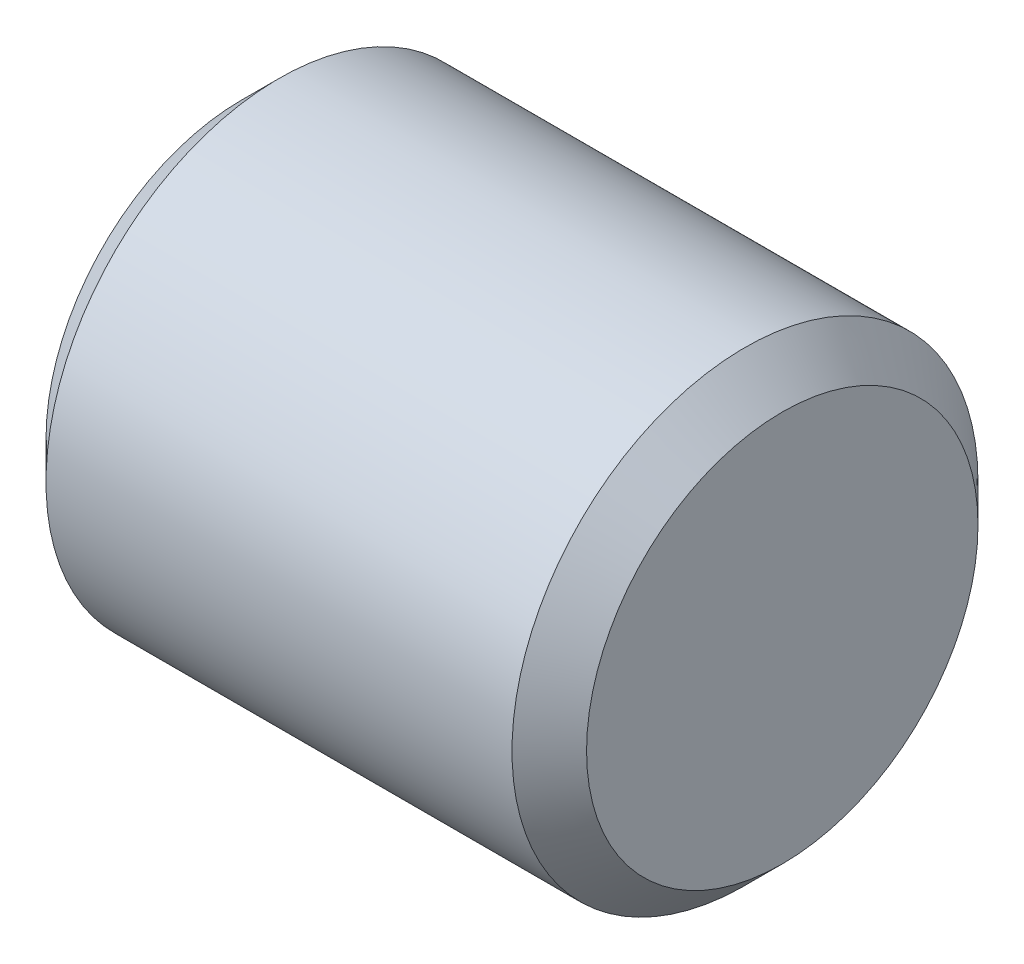
ISO-10303-21;
HEADER;
FILE_DESCRIPTION(('STEP AP214'),'2;1');
FILE_NAME('part.step','',(''),(''),'','','');
FILE_SCHEMA(('AUTOMOTIVE_DESIGN { 1 0 10303 214 1 1 1 1 }'));
ENDSEC;
DATA;
#1=APPLICATION_CONTEXT('core data for automotive mechanical design processes');
#2=APPLICATION_PROTOCOL_DEFINITION('international standard','automotive_design',2000,#1);
#3=PRODUCT_CONTEXT('',#1,'mechanical');
#4=PRODUCT('Part','Part','',(#3));
#5=PRODUCT_RELATED_PRODUCT_CATEGORY('part','',(#4));
#6=PRODUCT_DEFINITION_FORMATION('','',#4);
#7=PRODUCT_DEFINITION_CONTEXT('part definition',#1,'design');
#8=PRODUCT_DEFINITION('design','',#6,#7);
#9=PRODUCT_DEFINITION_SHAPE('','',#8);
#10=(LENGTH_UNIT() NAMED_UNIT(*) SI_UNIT(.MILLI.,.METRE.));
#11=(NAMED_UNIT(*) PLANE_ANGLE_UNIT() SI_UNIT($,.RADIAN.));
#12=(NAMED_UNIT(*) SI_UNIT($,.STERADIAN.) SOLID_ANGLE_UNIT());
#13=UNCERTAINTY_MEASURE_WITH_UNIT(LENGTH_MEASURE(1.E-05),#10,'distance_accuracy_value','');
#14=(GEOMETRIC_REPRESENTATION_CONTEXT(3) GLOBAL_UNCERTAINTY_ASSIGNED_CONTEXT((#13)) GLOBAL_UNIT_ASSIGNED_CONTEXT((#10,
#11,#12)) REPRESENTATION_CONTEXT('',''));
#15=CARTESIAN_POINT('',(0.,0.,0.));
#16=DIRECTION('',(0.,0.,1.));
#17=DIRECTION('',(1.,0.,0.));
#18=AXIS2_PLACEMENT_3D('',#15,#16,#17);
#19=CARTESIAN_POINT('',(18.415,0.,0.));
#20=DIRECTION('',(-1.,0.,0.));
#21=DIRECTION('',(0.,0.,1.));
#22=AXIS2_PLACEMENT_3D('',#19,#20,#21);
#23=CYLINDRICAL_SURFACE('',#22,7.9375);
#24=CARTESIAN_POINT('',(17.145,0.,0.));
#25=DIRECTION('',(1.,0.,0.));
#26=DIRECTION('',(0.,0.,-1.));
#27=AXIS2_PLACEMENT_3D('',#24,#25,#26);
#28=CIRCLE('',#27,7.9375);
#29=CARTESIAN_POINT('',(17.145,0.,-7.9375));
#30=VERTEX_POINT('',#29);
#31=EDGE_CURVE('E84',#30,#30,#28,.F.);
#32=ORIENTED_EDGE('',*,*,#31,.T.);
#33=EDGE_LOOP('',(#32));
#34=FACE_BOUND('',#33,.T.);
#35=CARTESIAN_POINT('',(1.27,0.,0.));
#36=DIRECTION('',(1.,0.,0.));
#37=DIRECTION('',(0.,0.,-1.));
#38=AXIS2_PLACEMENT_3D('',#35,#36,#37);
#39=CIRCLE('',#38,7.9375);
#40=CARTESIAN_POINT('',(1.27,0.,-7.9375));
#41=VERTEX_POINT('',#40);
#42=EDGE_CURVE('E81',#41,#41,#39,.T.);
#43=ORIENTED_EDGE('',*,*,#42,.T.);
#44=EDGE_LOOP('',(#43));
#45=FACE_BOUND('',#44,.T.);
#46=ADVANCED_FACE('F35',(#34,#45),#23,.T.);
#47=CARTESIAN_POINT('',(18.415,0.,0.));
#48=DIRECTION('',(1.,0.,0.));
#49=DIRECTION('',(0.,0.,-1.));
#50=AXIS2_PLACEMENT_3D('',#47,#48,#49);
#51=PLANE('',#50);
#52=CARTESIAN_POINT('',(18.415,0.,0.));
#53=DIRECTION('',(1.,0.,0.));
#54=DIRECTION('',(0.,0.,-1.));
#55=AXIS2_PLACEMENT_3D('',#52,#53,#54);
#56=CIRCLE('',#55,6.6675);
#57=CARTESIAN_POINT('',(18.415,0.,-6.6675));
#58=VERTEX_POINT('',#57);
#59=EDGE_CURVE('E78',#58,#58,#56,.T.);
#60=ORIENTED_EDGE('',*,*,#59,.T.);
#61=EDGE_LOOP('',(#60));
#62=FACE_BOUND('',#61,.T.);
#63=ADVANCED_FACE('F97',(#62),#51,.T.);
#64=CARTESIAN_POINT('',(0.,0.,0.));
#65=DIRECTION('',(1.,0.,0.));
#66=DIRECTION('',(0.,0.,-1.));
#67=AXIS2_PLACEMENT_3D('',#64,#65,#66);
#68=PLANE('',#67);
#69=CARTESIAN_POINT('',(0.,0.,0.));
#70=DIRECTION('',(-1.,0.,0.));
#71=DIRECTION('',(0.,0.,1.));
#72=AXIS2_PLACEMENT_3D('',#69,#70,#71);
#73=CIRCLE('',#72,3.81);
#74=CARTESIAN_POINT('',(0.,0.,3.81));
#75=VERTEX_POINT('',#74);
#76=EDGE_CURVE('E119',#75,#75,#73,.T.);
#77=ORIENTED_EDGE('',*,*,#76,.F.);
#78=EDGE_LOOP('',(#77));
#79=FACE_BOUND('',#78,.T.);
#80=CARTESIAN_POINT('',(0.,0.,0.));
#81=DIRECTION('',(1.,0.,0.));
#82=DIRECTION('',(0.,0.,-1.));
#83=AXIS2_PLACEMENT_3D('',#80,#81,#82);
#84=CIRCLE('',#83,6.66749999999999);
#85=CARTESIAN_POINT('',(0.,0.,-6.66749999999999));
#86=VERTEX_POINT('',#85);
#87=EDGE_CURVE('E43',#86,#86,#84,.F.);
#88=ORIENTED_EDGE('',*,*,#87,.T.);
#89=EDGE_LOOP('',(#88));
#90=FACE_BOUND('',#89,.T.);
#91=ADVANCED_FACE('F89',(#79,#90),#68,.F.);
#92=CARTESIAN_POINT('',(18.415,0.,0.));
#93=DIRECTION('',(-1.,0.,0.));
#94=DIRECTION('',(0.,0.,1.));
#95=AXIS2_PLACEMENT_3D('',#92,#93,#94);
#96=CONICAL_SURFACE('',#95,6.6675,0.785398163397444);
#97=ORIENTED_EDGE('',*,*,#31,.F.);
#98=EDGE_LOOP('',(#97));
#99=FACE_BOUND('',#98,.T.);
#100=ORIENTED_EDGE('',*,*,#59,.F.);
#101=EDGE_LOOP('',(#100));
#102=FACE_BOUND('',#101,.T.);
#103=ADVANCED_FACE('F93',(#99,#102),#96,.T.);
#104=CARTESIAN_POINT('',(1.27,0.,0.));
#105=DIRECTION('',(1.,0.,0.));
#106=DIRECTION('',(0.,0.,-1.));
#107=AXIS2_PLACEMENT_3D('',#104,#105,#106);
#108=CONICAL_SURFACE('',#107,7.9375,0.785398163397452);
#109=ORIENTED_EDGE('',*,*,#87,.F.);
#110=EDGE_LOOP('',(#109));
#111=FACE_BOUND('',#110,.T.);
#112=ORIENTED_EDGE('',*,*,#42,.F.);
#113=EDGE_LOOP('',(#112));
#114=FACE_BOUND('',#113,.T.);
#115=ADVANCED_FACE('F37',(#111,#114),#108,.T.);
#116=CARTESIAN_POINT('',(3.175,0.,0.));
#117=DIRECTION('',(-1.,0.,0.));
#118=DIRECTION('',(0.,0.,1.));
#119=AXIS2_PLACEMENT_3D('',#116,#117,#118);
#120=PLANE('',#119);
#121=CARTESIAN_POINT('',(3.175,0.,0.));
#122=DIRECTION('',(-1.,0.,0.));
#123=DIRECTION('',(0.,0.,1.));
#124=AXIS2_PLACEMENT_3D('',#121,#122,#123);
#125=CIRCLE('',#124,3.81);
#126=CARTESIAN_POINT('',(3.175,0.,3.81));
#127=VERTEX_POINT('',#126);
#128=EDGE_CURVE('E69',#127,#127,#125,.T.);
#129=ORIENTED_EDGE('',*,*,#128,.T.);
#130=EDGE_LOOP('',(#129));
#131=FACE_BOUND('',#130,.T.);
#132=DIRECTION('',(0.,0.,1.));
#133=VECTOR('',#132,1.);
#134=CARTESIAN_POINT('',(3.175,1.397,-2.85114292872174));
#135=LINE('',#134,#133);
#136=CARTESIAN_POINT('',(3.175,1.397,-2.85114292872174));
#137=VERTEX_POINT('',#136);
#138=CARTESIAN_POINT('',(3.175,1.397,2.85114292872174));
#139=VERTEX_POINT('',#138);
#140=EDGE_CURVE('E48',#137,#139,#135,.T.);
#141=ORIENTED_EDGE('',*,*,#140,.T.);
#142=CARTESIAN_POINT('',(3.175,0.,0.));
#143=DIRECTION('',(-1.,0.,0.));
#144=DIRECTION('',(0.,0.,1.));
#145=AXIS2_PLACEMENT_3D('',#142,#143,#144);
#146=CIRCLE('',#145,3.175);
#147=EDGE_CURVE('E12',#139,#137,#146,.F.);
#148=ORIENTED_EDGE('',*,*,#147,.T.);
#149=EDGE_LOOP('',(#141,#148));
#150=FACE_BOUND('',#149,.T.);
#151=ADVANCED_FACE('F62',(#131,#150),#120,.T.);
#152=CARTESIAN_POINT('',(3.175,0.,0.));
#153=DIRECTION('',(-1.,0.,0.));
#154=DIRECTION('',(0.,0.,1.));
#155=AXIS2_PLACEMENT_3D('',#152,#153,#154);
#156=CYLINDRICAL_SURFACE('',#155,3.81);
#157=ORIENTED_EDGE('',*,*,#128,.F.);
#158=EDGE_LOOP('',(#157));
#159=FACE_BOUND('',#158,.T.);
#160=ORIENTED_EDGE('',*,*,#76,.T.);
#161=EDGE_LOOP('',(#160));
#162=FACE_BOUND('',#161,.T.);
#163=ADVANCED_FACE('F127',(#159,#162),#156,.F.);
#164=CARTESIAN_POINT('',(15.24,0.,0.));
#165=DIRECTION('',(1.,0.,0.));
#166=DIRECTION('',(0.,0.,-1.));
#167=AXIS2_PLACEMENT_3D('',#164,#165,#166);
#168=PLANE('',#167);
#169=CARTESIAN_POINT('',(15.24,0.,0.));
#170=DIRECTION('',(1.,0.,0.));
#171=DIRECTION('',(0.,0.,-1.));
#172=AXIS2_PLACEMENT_3D('',#169,#170,#171);
#173=CIRCLE('',#172,3.175);
#174=CARTESIAN_POINT('',(15.24,1.397,-2.85114292872174));
#175=VERTEX_POINT('',#174);
#176=CARTESIAN_POINT('',(15.24,1.397,2.85114292872174));
#177=VERTEX_POINT('',#176);
#178=EDGE_CURVE('E72',#175,#177,#173,.F.);
#179=ORIENTED_EDGE('',*,*,#178,.T.);
#180=DIRECTION('',(0.,0.,-1.));
#181=VECTOR('',#180,1.);
#182=CARTESIAN_POINT('',(15.24,1.397,-2.85114292872174));
#183=LINE('',#182,#181);
#184=EDGE_CURVE('E56',#177,#175,#183,.T.);
#185=ORIENTED_EDGE('',*,*,#184,.T.);
#186=EDGE_LOOP('',(#179,#185));
#187=FACE_BOUND('',#186,.T.);
#188=ADVANCED_FACE('F129',(#187),#168,.F.);
#189=CARTESIAN_POINT('',(26.2396842747807,0.,0.));
#190=DIRECTION('',(-1.,0.,0.));
#191=DIRECTION('',(0.,0.,1.));
#192=AXIS2_PLACEMENT_3D('',#189,#190,#191);
#193=CYLINDRICAL_SURFACE('',#192,3.175);
#194=ORIENTED_EDGE('',*,*,#147,.F.);
#195=DIRECTION('',(-1.,0.,0.));
#196=VECTOR('',#195,1.);
#197=CARTESIAN_POINT('',(26.2396842747807,1.397,2.85114292872174));
#198=LINE('',#197,#196);
#199=EDGE_CURVE('E68',#177,#139,#198,.T.);
#200=ORIENTED_EDGE('',*,*,#199,.F.);
#201=ORIENTED_EDGE('',*,*,#178,.F.);
#202=DIRECTION('',(-1.,0.,0.));
#203=VECTOR('',#202,1.);
#204=CARTESIAN_POINT('',(26.2396842747807,1.397,-2.85114292872174));
#205=LINE('',#204,#203);
#206=EDGE_CURVE('E67',#175,#137,#205,.T.);
#207=ORIENTED_EDGE('',*,*,#206,.T.);
#208=EDGE_LOOP('',(#194,#200,#201,#207));
#209=FACE_BOUND('',#208,.T.);
#210=ADVANCED_FACE('F71',(#209),#193,.F.);
#211=CARTESIAN_POINT('',(26.2396842747807,1.397,-2.85114292872174));
#212=DIRECTION('',(0.,1.,0.));
#213=DIRECTION('',(0.,0.,1.));
#214=AXIS2_PLACEMENT_3D('',#211,#212,#213);
#215=PLANE('',#214);
#216=ORIENTED_EDGE('',*,*,#140,.F.);
#217=ORIENTED_EDGE('',*,*,#206,.F.);
#218=ORIENTED_EDGE('',*,*,#184,.F.);
#219=ORIENTED_EDGE('',*,*,#199,.T.);
#220=EDGE_LOOP('',(#216,#217,#218,#219));
#221=FACE_BOUND('',#220,.T.);
#222=ADVANCED_FACE('F66',(#221),#215,.F.);
#223=CLOSED_SHELL('',(#46,#63,#91,#103,#115,#151,#163,#188,#210,#222));
#224=MANIFOLD_SOLID_BREP('B2',#223);
#225=ADVANCED_BREP_SHAPE_REPRESENTATION('',(#18,#224),#14);
#226=SHAPE_DEFINITION_REPRESENTATION(#9,#225);
ENDSEC;
END-ISO-10303-21;
